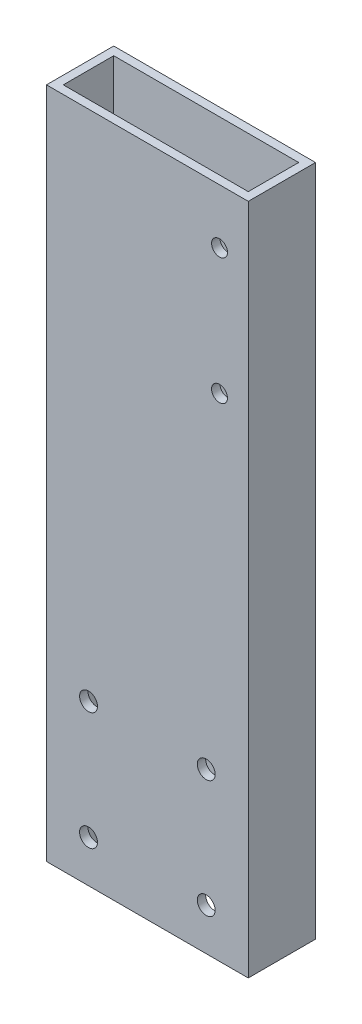
ISO-10303-21;
HEADER;
FILE_DESCRIPTION(('STEP AP214'),'2;1');
FILE_NAME('part.step','',(''),(''),'','','');
FILE_SCHEMA(('AUTOMOTIVE_DESIGN { 1 0 10303 214 1 1 1 1 }'));
ENDSEC;
DATA;
#1=APPLICATION_CONTEXT('core data for automotive mechanical design processes');
#2=APPLICATION_PROTOCOL_DEFINITION('international standard','automotive_design',2000,#1);
#3=PRODUCT_CONTEXT('',#1,'mechanical');
#4=PRODUCT('Part','Part','',(#3));
#5=PRODUCT_RELATED_PRODUCT_CATEGORY('part','',(#4));
#6=PRODUCT_DEFINITION_FORMATION('','',#4);
#7=PRODUCT_DEFINITION_CONTEXT('part definition',#1,'design');
#8=PRODUCT_DEFINITION('design','',#6,#7);
#9=PRODUCT_DEFINITION_SHAPE('','',#8);
#10=(LENGTH_UNIT() NAMED_UNIT(*) SI_UNIT(.MILLI.,.METRE.));
#11=(NAMED_UNIT(*) PLANE_ANGLE_UNIT() SI_UNIT($,.RADIAN.));
#12=(NAMED_UNIT(*) SI_UNIT($,.STERADIAN.) SOLID_ANGLE_UNIT());
#13=UNCERTAINTY_MEASURE_WITH_UNIT(LENGTH_MEASURE(1.E-05),#10,'distance_accuracy_value','');
#14=(GEOMETRIC_REPRESENTATION_CONTEXT(3) GLOBAL_UNCERTAINTY_ASSIGNED_CONTEXT((#13)) GLOBAL_UNIT_ASSIGNED_CONTEXT((#10,
#11,#12)) REPRESENTATION_CONTEXT('',''));
#15=CARTESIAN_POINT('',(0.,0.,0.));
#16=DIRECTION('',(0.,0.,1.));
#17=DIRECTION('',(1.,0.,0.));
#18=AXIS2_PLACEMENT_3D('',#15,#16,#17);
#19=CARTESIAN_POINT('',(0.,254.,0.));
#20=DIRECTION('',(0.,-1.,0.));
#21=DIRECTION('',(0.,0.,-1.));
#22=AXIS2_PLACEMENT_3D('',#19,#20,#21);
#23=PLANE('',#22);
#24=DIRECTION('',(0.,0.,1.));
#25=VECTOR('',#24,1.);
#26=CARTESIAN_POINT('',(0.,254.,0.));
#27=LINE('',#26,#25);
#28=CARTESIAN_POINT('',(0.,254.,-25.4));
#29=VERTEX_POINT('',#28);
#30=CARTESIAN_POINT('',(0.,254.,0.));
#31=VERTEX_POINT('',#30);
#32=EDGE_CURVE('E137',#29,#31,#27,.T.);
#33=ORIENTED_EDGE('',*,*,#32,.T.);
#34=DIRECTION('',(1.,0.,0.));
#35=VECTOR('',#34,1.);
#36=CARTESIAN_POINT('',(0.,254.,0.));
#37=LINE('',#36,#35);
#38=CARTESIAN_POINT('',(76.2,254.,0.));
#39=VERTEX_POINT('',#38);
#40=EDGE_CURVE('E140',#31,#39,#37,.T.);
#41=ORIENTED_EDGE('',*,*,#40,.T.);
#42=DIRECTION('',(0.,0.,-1.));
#43=VECTOR('',#42,1.);
#44=CARTESIAN_POINT('',(76.2,254.,0.));
#45=LINE('',#44,#43);
#46=CARTESIAN_POINT('',(76.2,254.,-25.4));
#47=VERTEX_POINT('',#46);
#48=EDGE_CURVE('E143',#39,#47,#45,.T.);
#49=ORIENTED_EDGE('',*,*,#48,.T.);
#50=DIRECTION('',(-1.,0.,0.));
#51=VECTOR('',#50,1.);
#52=CARTESIAN_POINT('',(0.,254.,-25.4));
#53=LINE('',#52,#51);
#54=EDGE_CURVE('E145',#47,#29,#53,.T.);
#55=ORIENTED_EDGE('',*,*,#54,.T.);
#56=EDGE_LOOP('',(#33,#41,#49,#55));
#57=FACE_BOUND('',#56,.T.);
#58=DIRECTION('',(0.,0.,1.));
#59=VECTOR('',#58,1.);
#60=CARTESIAN_POINT('',(3.175,254.,-3.175));
#61=LINE('',#60,#59);
#62=CARTESIAN_POINT('',(3.175,254.,-22.225));
#63=VERTEX_POINT('',#62);
#64=CARTESIAN_POINT('',(3.175,254.,-3.175));
#65=VERTEX_POINT('',#64);
#66=EDGE_CURVE('E99',#63,#65,#61,.T.);
#67=ORIENTED_EDGE('',*,*,#66,.F.);
#68=DIRECTION('',(-1.,0.,0.));
#69=VECTOR('',#68,1.);
#70=CARTESIAN_POINT('',(3.175,254.,-22.225));
#71=LINE('',#70,#69);
#72=CARTESIAN_POINT('',(73.025,254.,-22.225));
#73=VERTEX_POINT('',#72);
#74=EDGE_CURVE('E121',#73,#63,#71,.T.);
#75=ORIENTED_EDGE('',*,*,#74,.F.);
#76=DIRECTION('',(0.,0.,-1.));
#77=VECTOR('',#76,1.);
#78=CARTESIAN_POINT('',(73.025,254.,-3.175));
#79=LINE('',#78,#77);
#80=CARTESIAN_POINT('',(73.025,254.,-3.175));
#81=VERTEX_POINT('',#80);
#82=EDGE_CURVE('E119',#81,#73,#79,.T.);
#83=ORIENTED_EDGE('',*,*,#82,.F.);
#84=DIRECTION('',(1.,0.,0.));
#85=VECTOR('',#84,1.);
#86=CARTESIAN_POINT('',(3.175,254.,-3.175));
#87=LINE('',#86,#85);
#88=EDGE_CURVE('E107',#65,#81,#87,.T.);
#89=ORIENTED_EDGE('',*,*,#88,.F.);
#90=EDGE_LOOP('',(#67,#75,#83,#89));
#91=FACE_BOUND('',#90,.T.);
#92=ADVANCED_FACE('F32',(#57,#91),#23,.F.);
#93=CARTESIAN_POINT('',(0.,0.,0.));
#94=DIRECTION('',(0.,-1.,0.));
#95=DIRECTION('',(0.,0.,-1.));
#96=AXIS2_PLACEMENT_3D('',#93,#94,#95);
#97=PLANE('',#96);
#98=DIRECTION('',(0.,0.,1.));
#99=VECTOR('',#98,1.);
#100=CARTESIAN_POINT('',(0.,0.,0.));
#101=LINE('',#100,#99);
#102=CARTESIAN_POINT('',(0.,0.,-25.4));
#103=VERTEX_POINT('',#102);
#104=CARTESIAN_POINT('',(0.,0.,0.));
#105=VERTEX_POINT('',#104);
#106=EDGE_CURVE('E115',#103,#105,#101,.T.);
#107=ORIENTED_EDGE('',*,*,#106,.F.);
#108=DIRECTION('',(-1.,0.,0.));
#109=VECTOR('',#108,1.);
#110=CARTESIAN_POINT('',(0.,0.,-25.4));
#111=LINE('',#110,#109);
#112=CARTESIAN_POINT('',(76.2,0.,-25.4));
#113=VERTEX_POINT('',#112);
#114=EDGE_CURVE('E141',#113,#103,#111,.T.);
#115=ORIENTED_EDGE('',*,*,#114,.F.);
#116=DIRECTION('',(0.,0.,-1.));
#117=VECTOR('',#116,1.);
#118=CARTESIAN_POINT('',(76.2,0.,0.));
#119=LINE('',#118,#117);
#120=CARTESIAN_POINT('',(76.2,0.,0.));
#121=VERTEX_POINT('',#120);
#122=EDGE_CURVE('E152',#121,#113,#119,.T.);
#123=ORIENTED_EDGE('',*,*,#122,.F.);
#124=DIRECTION('',(1.,0.,0.));
#125=VECTOR('',#124,1.);
#126=CARTESIAN_POINT('',(0.,0.,0.));
#127=LINE('',#126,#125);
#128=EDGE_CURVE('E150',#105,#121,#127,.T.);
#129=ORIENTED_EDGE('',*,*,#128,.F.);
#130=EDGE_LOOP('',(#107,#115,#123,#129));
#131=FACE_BOUND('',#130,.T.);
#132=DIRECTION('',(-1.,0.,0.));
#133=VECTOR('',#132,1.);
#134=CARTESIAN_POINT('',(3.175,0.,-22.225));
#135=LINE('',#134,#133);
#136=CARTESIAN_POINT('',(73.025,0.,-22.225));
#137=VERTEX_POINT('',#136);
#138=CARTESIAN_POINT('',(3.175,0.,-22.225));
#139=VERTEX_POINT('',#138);
#140=EDGE_CURVE('E108',#137,#139,#135,.T.);
#141=ORIENTED_EDGE('',*,*,#140,.T.);
#142=DIRECTION('',(0.,0.,1.));
#143=VECTOR('',#142,1.);
#144=CARTESIAN_POINT('',(3.175,0.,-3.175));
#145=LINE('',#144,#143);
#146=CARTESIAN_POINT('',(3.175,0.,-3.175));
#147=VERTEX_POINT('',#146);
#148=EDGE_CURVE('E57',#139,#147,#145,.T.);
#149=ORIENTED_EDGE('',*,*,#148,.T.);
#150=DIRECTION('',(1.,0.,0.));
#151=VECTOR('',#150,1.);
#152=CARTESIAN_POINT('',(3.175,0.,-3.175));
#153=LINE('',#152,#151);
#154=CARTESIAN_POINT('',(73.025,0.,-3.175));
#155=VERTEX_POINT('',#154);
#156=EDGE_CURVE('E114',#147,#155,#153,.T.);
#157=ORIENTED_EDGE('',*,*,#156,.T.);
#158=DIRECTION('',(0.,0.,-1.));
#159=VECTOR('',#158,1.);
#160=CARTESIAN_POINT('',(73.025,0.,-3.175));
#161=LINE('',#160,#159);
#162=EDGE_CURVE('E129',#155,#137,#161,.T.);
#163=ORIENTED_EDGE('',*,*,#162,.T.);
#164=EDGE_LOOP('',(#141,#149,#157,#163));
#165=FACE_BOUND('',#164,.T.);
#166=ADVANCED_FACE('F246',(#131,#165),#97,.T.);
#167=CARTESIAN_POINT('',(0.,254.,0.));
#168=DIRECTION('',(1.,0.,0.));
#169=DIRECTION('',(0.,0.,-1.));
#170=AXIS2_PLACEMENT_3D('',#167,#168,#169);
#171=PLANE('',#170);
#172=ORIENTED_EDGE('',*,*,#106,.T.);
#173=DIRECTION('',(0.,-1.,0.));
#174=VECTOR('',#173,1.);
#175=CARTESIAN_POINT('',(0.,254.,0.));
#176=LINE('',#175,#174);
#177=EDGE_CURVE('E11',#31,#105,#176,.T.);
#178=ORIENTED_EDGE('',*,*,#177,.F.);
#179=ORIENTED_EDGE('',*,*,#32,.F.);
#180=DIRECTION('',(0.,-1.,0.));
#181=VECTOR('',#180,1.);
#182=CARTESIAN_POINT('',(0.,254.,-25.4));
#183=LINE('',#182,#181);
#184=EDGE_CURVE('E147',#29,#103,#183,.T.);
#185=ORIENTED_EDGE('',*,*,#184,.T.);
#186=EDGE_LOOP('',(#172,#178,#179,#185));
#187=FACE_BOUND('',#186,.T.);
#188=ADVANCED_FACE('F34',(#187),#171,.F.);
#189=CARTESIAN_POINT('',(0.,254.,0.));
#190=DIRECTION('',(0.,0.,-1.));
#191=DIRECTION('',(-1.,0.,0.));
#192=AXIS2_PLACEMENT_3D('',#189,#190,#191);
#193=PLANE('',#192);
#194=CARTESIAN_POINT('',(65.3474321253445,233.362499999999,0.));
#195=DIRECTION('',(0.,0.,-1.));
#196=DIRECTION('',(-1.,0.,0.));
#197=AXIS2_PLACEMENT_3D('',#194,#195,#196);
#198=CIRCLE('',#197,3.);
#199=CARTESIAN_POINT('',(62.3474321253445,233.362499999999,0.));
#200=VERTEX_POINT('',#199);
#201=EDGE_CURVE('E270',#200,#200,#198,.T.);
#202=ORIENTED_EDGE('',*,*,#201,.T.);
#203=EDGE_LOOP('',(#202));
#204=FACE_BOUND('',#203,.T.);
#205=CARTESIAN_POINT('',(65.3474321253444,185.737499999999,0.));
#206=DIRECTION('',(0.,0.,-1.));
#207=DIRECTION('',(-1.,0.,0.));
#208=AXIS2_PLACEMENT_3D('',#205,#206,#207);
#209=CIRCLE('',#208,2.99999999999999);
#210=CARTESIAN_POINT('',(62.3474321253444,185.737499999999,0.));
#211=VERTEX_POINT('',#210);
#212=EDGE_CURVE('E181',#211,#211,#209,.T.);
#213=ORIENTED_EDGE('',*,*,#212,.T.);
#214=EDGE_LOOP('',(#213));
#215=FACE_BOUND('',#214,.T.);
#216=CARTESIAN_POINT('',(15.875,15.875,0.));
#217=DIRECTION('',(0.,0.,-1.));
#218=DIRECTION('',(-1.,0.,0.));
#219=AXIS2_PLACEMENT_3D('',#216,#217,#218);
#220=CIRCLE('',#219,3.3782);
#221=CARTESIAN_POINT('',(12.4968,15.875,0.));
#222=VERTEX_POINT('',#221);
#223=EDGE_CURVE('E170',#222,#222,#220,.T.);
#224=ORIENTED_EDGE('',*,*,#223,.T.);
#225=EDGE_LOOP('',(#224));
#226=FACE_BOUND('',#225,.T.);
#227=CARTESIAN_POINT('',(15.875,60.325,0.));
#228=DIRECTION('',(0.,0.,-1.));
#229=DIRECTION('',(-1.,0.,0.));
#230=AXIS2_PLACEMENT_3D('',#227,#228,#229);
#231=CIRCLE('',#230,3.37820000000001);
#232=CARTESIAN_POINT('',(12.4968,60.325,0.));
#233=VERTEX_POINT('',#232);
#234=EDGE_CURVE('E203',#233,#233,#231,.T.);
#235=ORIENTED_EDGE('',*,*,#234,.T.);
#236=EDGE_LOOP('',(#235));
#237=FACE_BOUND('',#236,.T.);
#238=CARTESIAN_POINT('',(60.325,60.325,0.));
#239=DIRECTION('',(0.,0.,-1.));
#240=DIRECTION('',(-1.,0.,0.));
#241=AXIS2_PLACEMENT_3D('',#238,#239,#240);
#242=CIRCLE('',#241,3.3782);
#243=CARTESIAN_POINT('',(56.9468,60.325,0.));
#244=VERTEX_POINT('',#243);
#245=EDGE_CURVE('E209',#244,#244,#242,.T.);
#246=ORIENTED_EDGE('',*,*,#245,.T.);
#247=EDGE_LOOP('',(#246));
#248=FACE_BOUND('',#247,.T.);
#249=CARTESIAN_POINT('',(60.325,15.875,0.));
#250=DIRECTION('',(0.,0.,-1.));
#251=DIRECTION('',(-1.,0.,0.));
#252=AXIS2_PLACEMENT_3D('',#249,#250,#251);
#253=CIRCLE('',#252,3.37819999999999);
#254=CARTESIAN_POINT('',(56.9468,15.875,0.));
#255=VERTEX_POINT('',#254);
#256=EDGE_CURVE('E165',#255,#255,#253,.T.);
#257=ORIENTED_EDGE('',*,*,#256,.T.);
#258=EDGE_LOOP('',(#257));
#259=FACE_BOUND('',#258,.T.);
#260=ORIENTED_EDGE('',*,*,#128,.T.);
#261=DIRECTION('',(0.,-1.,0.));
#262=VECTOR('',#261,1.);
#263=CARTESIAN_POINT('',(76.2,254.,0.));
#264=LINE('',#263,#262);
#265=EDGE_CURVE('E41',#39,#121,#264,.T.);
#266=ORIENTED_EDGE('',*,*,#265,.F.);
#267=ORIENTED_EDGE('',*,*,#40,.F.);
#268=ORIENTED_EDGE('',*,*,#177,.T.);
#269=EDGE_LOOP('',(#260,#266,#267,#268));
#270=FACE_BOUND('',#269,.T.);
#271=ADVANCED_FACE('F260',(#204,#215,#226,#237,#248,#259,#270),#193,.F.);
#272=CARTESIAN_POINT('',(76.2,254.,0.));
#273=DIRECTION('',(-1.,0.,0.));
#274=DIRECTION('',(0.,0.,1.));
#275=AXIS2_PLACEMENT_3D('',#272,#273,#274);
#276=PLANE('',#275);
#277=ORIENTED_EDGE('',*,*,#122,.T.);
#278=DIRECTION('',(0.,-1.,0.));
#279=VECTOR('',#278,1.);
#280=CARTESIAN_POINT('',(76.2,254.,-25.4));
#281=LINE('',#280,#279);
#282=EDGE_CURVE('E157',#47,#113,#281,.T.);
#283=ORIENTED_EDGE('',*,*,#282,.F.);
#284=ORIENTED_EDGE('',*,*,#48,.F.);
#285=ORIENTED_EDGE('',*,*,#265,.T.);
#286=EDGE_LOOP('',(#277,#283,#284,#285));
#287=FACE_BOUND('',#286,.T.);
#288=ADVANCED_FACE('F257',(#287),#276,.F.);
#289=CARTESIAN_POINT('',(0.,254.,-25.4));
#290=DIRECTION('',(0.,0.,1.));
#291=DIRECTION('',(1.,0.,0.));
#292=AXIS2_PLACEMENT_3D('',#289,#290,#291);
#293=PLANE('',#292);
#294=CARTESIAN_POINT('',(65.3474321253445,233.362499999999,-25.4));
#295=DIRECTION('',(0.,0.,-1.));
#296=DIRECTION('',(-1.,0.,0.));
#297=AXIS2_PLACEMENT_3D('',#294,#295,#296);
#298=CIRCLE('',#297,3.);
#299=CARTESIAN_POINT('',(62.3474321253445,233.362499999999,-25.4));
#300=VERTEX_POINT('',#299);
#301=EDGE_CURVE('E338',#300,#300,#298,.T.);
#302=ORIENTED_EDGE('',*,*,#301,.F.);
#303=EDGE_LOOP('',(#302));
#304=FACE_BOUND('',#303,.T.);
#305=CARTESIAN_POINT('',(65.3474321253444,185.737499999999,-25.4));
#306=DIRECTION('',(0.,0.,-1.));
#307=DIRECTION('',(-1.,0.,0.));
#308=AXIS2_PLACEMENT_3D('',#305,#306,#307);
#309=CIRCLE('',#308,2.99999999999999);
#310=CARTESIAN_POINT('',(62.3474321253444,185.737499999999,-25.4));
#311=VERTEX_POINT('',#310);
#312=EDGE_CURVE('E188',#311,#311,#309,.T.);
#313=ORIENTED_EDGE('',*,*,#312,.F.);
#314=EDGE_LOOP('',(#313));
#315=FACE_BOUND('',#314,.T.);
#316=CARTESIAN_POINT('',(15.875,15.875,-25.4));
#317=DIRECTION('',(0.,0.,-1.));
#318=DIRECTION('',(-1.,0.,0.));
#319=AXIS2_PLACEMENT_3D('',#316,#317,#318);
#320=CIRCLE('',#319,3.3782);
#321=CARTESIAN_POINT('',(12.4968,15.875,-25.4));
#322=VERTEX_POINT('',#321);
#323=EDGE_CURVE('E200',#322,#322,#320,.T.);
#324=ORIENTED_EDGE('',*,*,#323,.F.);
#325=EDGE_LOOP('',(#324));
#326=FACE_BOUND('',#325,.T.);
#327=CARTESIAN_POINT('',(15.875,60.325,-25.4));
#328=DIRECTION('',(0.,0.,-1.));
#329=DIRECTION('',(-1.,0.,0.));
#330=AXIS2_PLACEMENT_3D('',#327,#328,#329);
#331=CIRCLE('',#330,3.37820000000001);
#332=CARTESIAN_POINT('',(12.4968,60.325,-25.4));
#333=VERTEX_POINT('',#332);
#334=EDGE_CURVE('E206',#333,#333,#331,.T.);
#335=ORIENTED_EDGE('',*,*,#334,.F.);
#336=EDGE_LOOP('',(#335));
#337=FACE_BOUND('',#336,.T.);
#338=CARTESIAN_POINT('',(60.325,60.325,-25.4));
#339=DIRECTION('',(0.,0.,-1.));
#340=DIRECTION('',(-1.,0.,0.));
#341=AXIS2_PLACEMENT_3D('',#338,#339,#340);
#342=CIRCLE('',#341,3.3782);
#343=CARTESIAN_POINT('',(56.9468,60.325,-25.4));
#344=VERTEX_POINT('',#343);
#345=EDGE_CURVE('E185',#344,#344,#342,.T.);
#346=ORIENTED_EDGE('',*,*,#345,.F.);
#347=EDGE_LOOP('',(#346));
#348=FACE_BOUND('',#347,.T.);
#349=CARTESIAN_POINT('',(60.325,15.875,-25.4));
#350=DIRECTION('',(0.,0.,-1.));
#351=DIRECTION('',(-1.,0.,0.));
#352=AXIS2_PLACEMENT_3D('',#349,#350,#351);
#353=CIRCLE('',#352,3.37819999999999);
#354=CARTESIAN_POINT('',(56.9468,15.875,-25.4));
#355=VERTEX_POINT('',#354);
#356=EDGE_CURVE('E220',#355,#355,#353,.T.);
#357=ORIENTED_EDGE('',*,*,#356,.F.);
#358=EDGE_LOOP('',(#357));
#359=FACE_BOUND('',#358,.T.);
#360=ORIENTED_EDGE('',*,*,#114,.T.);
#361=ORIENTED_EDGE('',*,*,#184,.F.);
#362=ORIENTED_EDGE('',*,*,#54,.F.);
#363=ORIENTED_EDGE('',*,*,#282,.T.);
#364=EDGE_LOOP('',(#360,#361,#362,#363));
#365=FACE_BOUND('',#364,.T.);
#366=ADVANCED_FACE('F241',(#304,#315,#326,#337,#348,#359,#365),#293,.F.);
#367=CARTESIAN_POINT('',(3.175,254.,-3.175));
#368=DIRECTION('',(1.,0.,0.));
#369=DIRECTION('',(0.,0.,-1.));
#370=AXIS2_PLACEMENT_3D('',#367,#368,#369);
#371=PLANE('',#370);
#372=ORIENTED_EDGE('',*,*,#148,.F.);
#373=DIRECTION('',(0.,-1.,0.));
#374=VECTOR('',#373,1.);
#375=CARTESIAN_POINT('',(3.175,254.,-22.225));
#376=LINE('',#375,#374);
#377=EDGE_CURVE('E103',#63,#139,#376,.T.);
#378=ORIENTED_EDGE('',*,*,#377,.F.);
#379=ORIENTED_EDGE('',*,*,#66,.T.);
#380=DIRECTION('',(0.,-1.,0.));
#381=VECTOR('',#380,1.);
#382=CARTESIAN_POINT('',(3.175,254.,-3.175));
#383=LINE('',#382,#381);
#384=EDGE_CURVE('E102',#65,#147,#383,.T.);
#385=ORIENTED_EDGE('',*,*,#384,.T.);
#386=EDGE_LOOP('',(#372,#378,#379,#385));
#387=FACE_BOUND('',#386,.T.);
#388=ADVANCED_FACE('F101',(#387),#371,.T.);
#389=CARTESIAN_POINT('',(3.175,254.,-3.175));
#390=DIRECTION('',(0.,0.,-1.));
#391=DIRECTION('',(-1.,0.,0.));
#392=AXIS2_PLACEMENT_3D('',#389,#390,#391);
#393=PLANE('',#392);
#394=CARTESIAN_POINT('',(65.3474321253445,233.362499999999,-3.175));
#395=DIRECTION('',(0.,0.,-1.));
#396=DIRECTION('',(-1.,0.,0.));
#397=AXIS2_PLACEMENT_3D('',#394,#395,#396);
#398=CIRCLE('',#397,3.);
#399=CARTESIAN_POINT('',(62.3474321253445,233.362499999999,-3.175));
#400=VERTEX_POINT('',#399);
#401=EDGE_CURVE('E193',#400,#400,#398,.T.);
#402=ORIENTED_EDGE('',*,*,#401,.F.);
#403=EDGE_LOOP('',(#402));
#404=FACE_BOUND('',#403,.T.);
#405=CARTESIAN_POINT('',(65.3474321253444,185.737499999999,-3.175));
#406=DIRECTION('',(0.,0.,-1.));
#407=DIRECTION('',(-1.,0.,0.));
#408=AXIS2_PLACEMENT_3D('',#405,#406,#407);
#409=CIRCLE('',#408,2.99999999999999);
#410=CARTESIAN_POINT('',(62.3474321253444,185.737499999999,-3.175));
#411=VERTEX_POINT('',#410);
#412=EDGE_CURVE('E180',#411,#411,#409,.T.);
#413=ORIENTED_EDGE('',*,*,#412,.F.);
#414=EDGE_LOOP('',(#413));
#415=FACE_BOUND('',#414,.T.);
#416=CARTESIAN_POINT('',(15.875,15.875,-3.175));
#417=DIRECTION('',(0.,0.,-1.));
#418=DIRECTION('',(-1.,0.,0.));
#419=AXIS2_PLACEMENT_3D('',#416,#417,#418);
#420=CIRCLE('',#419,3.3782);
#421=CARTESIAN_POINT('',(12.4968,15.875,-3.175));
#422=VERTEX_POINT('',#421);
#423=EDGE_CURVE('E177',#422,#422,#420,.T.);
#424=ORIENTED_EDGE('',*,*,#423,.F.);
#425=EDGE_LOOP('',(#424));
#426=FACE_BOUND('',#425,.T.);
#427=CARTESIAN_POINT('',(15.875,60.325,-3.175));
#428=DIRECTION('',(0.,0.,-1.));
#429=DIRECTION('',(-1.,0.,0.));
#430=AXIS2_PLACEMENT_3D('',#427,#428,#429);
#431=CIRCLE('',#430,3.37820000000001);
#432=CARTESIAN_POINT('',(12.4968,60.325,-3.175));
#433=VERTEX_POINT('',#432);
#434=EDGE_CURVE('E174',#433,#433,#431,.T.);
#435=ORIENTED_EDGE('',*,*,#434,.F.);
#436=EDGE_LOOP('',(#435));
#437=FACE_BOUND('',#436,.T.);
#438=CARTESIAN_POINT('',(60.325,60.325,-3.175));
#439=DIRECTION('',(0.,0.,-1.));
#440=DIRECTION('',(-1.,0.,0.));
#441=AXIS2_PLACEMENT_3D('',#438,#439,#440);
#442=CIRCLE('',#441,3.3782);
#443=CARTESIAN_POINT('',(56.9468,60.325,-3.175));
#444=VERTEX_POINT('',#443);
#445=EDGE_CURVE('E169',#444,#444,#442,.T.);
#446=ORIENTED_EDGE('',*,*,#445,.F.);
#447=EDGE_LOOP('',(#446));
#448=FACE_BOUND('',#447,.T.);
#449=CARTESIAN_POINT('',(60.325,15.875,-3.175));
#450=DIRECTION('',(0.,0.,-1.));
#451=DIRECTION('',(-1.,0.,0.));
#452=AXIS2_PLACEMENT_3D('',#449,#450,#451);
#453=CIRCLE('',#452,3.37819999999999);
#454=CARTESIAN_POINT('',(56.9468,15.875,-3.175));
#455=VERTEX_POINT('',#454);
#456=EDGE_CURVE('E127',#455,#455,#453,.T.);
#457=ORIENTED_EDGE('',*,*,#456,.F.);
#458=EDGE_LOOP('',(#457));
#459=FACE_BOUND('',#458,.T.);
#460=ORIENTED_EDGE('',*,*,#156,.F.);
#461=ORIENTED_EDGE('',*,*,#384,.F.);
#462=ORIENTED_EDGE('',*,*,#88,.T.);
#463=DIRECTION('',(0.,-1.,0.));
#464=VECTOR('',#463,1.);
#465=CARTESIAN_POINT('',(73.025,254.,-3.175));
#466=LINE('',#465,#464);
#467=EDGE_CURVE('E116',#81,#155,#466,.T.);
#468=ORIENTED_EDGE('',*,*,#467,.T.);
#469=EDGE_LOOP('',(#460,#461,#462,#468));
#470=FACE_BOUND('',#469,.T.);
#471=ADVANCED_FACE('F111',(#404,#415,#426,#437,#448,#459,#470),#393,.T.);
#472=CARTESIAN_POINT('',(73.025,254.,-3.175));
#473=DIRECTION('',(-1.,0.,0.));
#474=DIRECTION('',(0.,0.,1.));
#475=AXIS2_PLACEMENT_3D('',#472,#473,#474);
#476=PLANE('',#475);
#477=ORIENTED_EDGE('',*,*,#162,.F.);
#478=ORIENTED_EDGE('',*,*,#467,.F.);
#479=ORIENTED_EDGE('',*,*,#82,.T.);
#480=DIRECTION('',(0.,-1.,0.));
#481=VECTOR('',#480,1.);
#482=CARTESIAN_POINT('',(73.025,254.,-22.225));
#483=LINE('',#482,#481);
#484=EDGE_CURVE('E49',#73,#137,#483,.T.);
#485=ORIENTED_EDGE('',*,*,#484,.T.);
#486=EDGE_LOOP('',(#477,#478,#479,#485));
#487=FACE_BOUND('',#486,.T.);
#488=ADVANCED_FACE('F231',(#487),#476,.T.);
#489=CARTESIAN_POINT('',(3.175,254.,-22.225));
#490=DIRECTION('',(0.,0.,1.));
#491=DIRECTION('',(1.,0.,0.));
#492=AXIS2_PLACEMENT_3D('',#489,#490,#491);
#493=PLANE('',#492);
#494=CARTESIAN_POINT('',(65.3474321253445,233.362499999999,-22.225));
#495=DIRECTION('',(0.,0.,1.));
#496=DIRECTION('',(1.,0.,0.));
#497=AXIS2_PLACEMENT_3D('',#494,#495,#496);
#498=CIRCLE('',#497,3.);
#499=CARTESIAN_POINT('',(68.3474321253445,233.362499999999,-22.225));
#500=VERTEX_POINT('',#499);
#501=EDGE_CURVE('E36',#500,#500,#498,.T.);
#502=ORIENTED_EDGE('',*,*,#501,.F.);
#503=EDGE_LOOP('',(#502));
#504=FACE_BOUND('',#503,.T.);
#505=CARTESIAN_POINT('',(65.3474321253444,185.737499999999,-22.225));
#506=DIRECTION('',(0.,0.,1.));
#507=DIRECTION('',(1.,0.,0.));
#508=AXIS2_PLACEMENT_3D('',#505,#506,#507);
#509=CIRCLE('',#508,2.99999999999999);
#510=CARTESIAN_POINT('',(68.3474321253444,185.737499999999,-22.225));
#511=VERTEX_POINT('',#510);
#512=EDGE_CURVE('E178',#511,#511,#509,.T.);
#513=ORIENTED_EDGE('',*,*,#512,.F.);
#514=EDGE_LOOP('',(#513));
#515=FACE_BOUND('',#514,.T.);
#516=CARTESIAN_POINT('',(15.875,15.875,-22.225));
#517=DIRECTION('',(0.,0.,1.));
#518=DIRECTION('',(1.,0.,0.));
#519=AXIS2_PLACEMENT_3D('',#516,#517,#518);
#520=CIRCLE('',#519,3.3782);
#521=CARTESIAN_POINT('',(19.2532,15.875,-22.225));
#522=VERTEX_POINT('',#521);
#523=EDGE_CURVE('E175',#522,#522,#520,.T.);
#524=ORIENTED_EDGE('',*,*,#523,.F.);
#525=EDGE_LOOP('',(#524));
#526=FACE_BOUND('',#525,.T.);
#527=CARTESIAN_POINT('',(15.875,60.325,-22.225));
#528=DIRECTION('',(0.,0.,1.));
#529=DIRECTION('',(1.,0.,0.));
#530=AXIS2_PLACEMENT_3D('',#527,#528,#529);
#531=CIRCLE('',#530,3.37820000000001);
#532=CARTESIAN_POINT('',(19.2532,60.325,-22.225));
#533=VERTEX_POINT('',#532);
#534=EDGE_CURVE('E171',#533,#533,#531,.T.);
#535=ORIENTED_EDGE('',*,*,#534,.F.);
#536=EDGE_LOOP('',(#535));
#537=FACE_BOUND('',#536,.T.);
#538=CARTESIAN_POINT('',(60.325,60.325,-22.225));
#539=DIRECTION('',(0.,0.,1.));
#540=DIRECTION('',(1.,0.,0.));
#541=AXIS2_PLACEMENT_3D('',#538,#539,#540);
#542=CIRCLE('',#541,3.3782);
#543=CARTESIAN_POINT('',(63.7032,60.325,-22.225));
#544=VERTEX_POINT('',#543);
#545=EDGE_CURVE('E166',#544,#544,#542,.T.);
#546=ORIENTED_EDGE('',*,*,#545,.F.);
#547=EDGE_LOOP('',(#546));
#548=FACE_BOUND('',#547,.T.);
#549=CARTESIAN_POINT('',(60.325,15.875,-22.225));
#550=DIRECTION('',(0.,0.,1.));
#551=DIRECTION('',(1.,0.,0.));
#552=AXIS2_PLACEMENT_3D('',#549,#550,#551);
#553=CIRCLE('',#552,3.37819999999999);
#554=CARTESIAN_POINT('',(63.7032,15.875,-22.225));
#555=VERTEX_POINT('',#554);
#556=EDGE_CURVE('E162',#555,#555,#553,.T.);
#557=ORIENTED_EDGE('',*,*,#556,.F.);
#558=EDGE_LOOP('',(#557));
#559=FACE_BOUND('',#558,.T.);
#560=ORIENTED_EDGE('',*,*,#140,.F.);
#561=ORIENTED_EDGE('',*,*,#484,.F.);
#562=ORIENTED_EDGE('',*,*,#74,.T.);
#563=ORIENTED_EDGE('',*,*,#377,.T.);
#564=EDGE_LOOP('',(#560,#561,#562,#563));
#565=FACE_BOUND('',#564,.T.);
#566=ADVANCED_FACE('F238',(#504,#515,#526,#537,#548,#559,#565),#493,.T.);
#567=CARTESIAN_POINT('',(60.325,15.875,0.));
#568=DIRECTION('',(0.,0.,-1.));
#569=DIRECTION('',(-1.,0.,0.));
#570=AXIS2_PLACEMENT_3D('',#567,#568,#569);
#571=CYLINDRICAL_SURFACE('',#570,3.37819999999999);
#572=ORIENTED_EDGE('',*,*,#556,.T.);
#573=EDGE_LOOP('',(#572));
#574=FACE_BOUND('',#573,.T.);
#575=ORIENTED_EDGE('',*,*,#356,.T.);
#576=EDGE_LOOP('',(#575));
#577=FACE_BOUND('',#576,.T.);
#578=ADVANCED_FACE('F294',(#574,#577),#571,.F.);
#579=ORIENTED_EDGE('',*,*,#456,.T.);
#580=EDGE_LOOP('',(#579));
#581=FACE_BOUND('',#580,.T.);
#582=ORIENTED_EDGE('',*,*,#256,.F.);
#583=EDGE_LOOP('',(#582));
#584=FACE_BOUND('',#583,.T.);
#585=ADVANCED_FACE('F227',(#581,#584),#571,.F.);
#586=CARTESIAN_POINT('',(60.325,60.325,0.));
#587=DIRECTION('',(0.,0.,-1.));
#588=DIRECTION('',(-1.,0.,0.));
#589=AXIS2_PLACEMENT_3D('',#586,#587,#588);
#590=CYLINDRICAL_SURFACE('',#589,3.3782);
#591=ORIENTED_EDGE('',*,*,#545,.T.);
#592=EDGE_LOOP('',(#591));
#593=FACE_BOUND('',#592,.T.);
#594=ORIENTED_EDGE('',*,*,#345,.T.);
#595=EDGE_LOOP('',(#594));
#596=FACE_BOUND('',#595,.T.);
#597=ADVANCED_FACE('F305',(#593,#596),#590,.F.);
#598=CARTESIAN_POINT('',(15.875,60.325,0.));
#599=DIRECTION('',(0.,0.,-1.));
#600=DIRECTION('',(-1.,0.,0.));
#601=AXIS2_PLACEMENT_3D('',#598,#599,#600);
#602=CYLINDRICAL_SURFACE('',#601,3.37820000000001);
#603=ORIENTED_EDGE('',*,*,#534,.T.);
#604=EDGE_LOOP('',(#603));
#605=FACE_BOUND('',#604,.T.);
#606=ORIENTED_EDGE('',*,*,#334,.T.);
#607=EDGE_LOOP('',(#606));
#608=FACE_BOUND('',#607,.T.);
#609=ADVANCED_FACE('F308',(#605,#608),#602,.F.);
#610=CARTESIAN_POINT('',(15.875,15.875,0.));
#611=DIRECTION('',(0.,0.,-1.));
#612=DIRECTION('',(-1.,0.,0.));
#613=AXIS2_PLACEMENT_3D('',#610,#611,#612);
#614=CYLINDRICAL_SURFACE('',#613,3.3782);
#615=ORIENTED_EDGE('',*,*,#523,.T.);
#616=EDGE_LOOP('',(#615));
#617=FACE_BOUND('',#616,.T.);
#618=ORIENTED_EDGE('',*,*,#323,.T.);
#619=EDGE_LOOP('',(#618));
#620=FACE_BOUND('',#619,.T.);
#621=ADVANCED_FACE('F313',(#617,#620),#614,.F.);
#622=ORIENTED_EDGE('',*,*,#445,.T.);
#623=EDGE_LOOP('',(#622));
#624=FACE_BOUND('',#623,.T.);
#625=ORIENTED_EDGE('',*,*,#245,.F.);
#626=EDGE_LOOP('',(#625));
#627=FACE_BOUND('',#626,.T.);
#628=ADVANCED_FACE('F310',(#624,#627),#590,.F.);
#629=ORIENTED_EDGE('',*,*,#434,.T.);
#630=EDGE_LOOP('',(#629));
#631=FACE_BOUND('',#630,.T.);
#632=ORIENTED_EDGE('',*,*,#234,.F.);
#633=EDGE_LOOP('',(#632));
#634=FACE_BOUND('',#633,.T.);
#635=ADVANCED_FACE('F315',(#631,#634),#602,.F.);
#636=ORIENTED_EDGE('',*,*,#423,.T.);
#637=EDGE_LOOP('',(#636));
#638=FACE_BOUND('',#637,.T.);
#639=ORIENTED_EDGE('',*,*,#223,.F.);
#640=EDGE_LOOP('',(#639));
#641=FACE_BOUND('',#640,.T.);
#642=ADVANCED_FACE('F319',(#638,#641),#614,.F.);
#643=CARTESIAN_POINT('',(65.3474321253444,185.737499999999,0.));
#644=DIRECTION('',(0.,0.,-1.));
#645=DIRECTION('',(-1.,0.,0.));
#646=AXIS2_PLACEMENT_3D('',#643,#644,#645);
#647=CYLINDRICAL_SURFACE('',#646,2.99999999999999);
#648=ORIENTED_EDGE('',*,*,#512,.T.);
#649=EDGE_LOOP('',(#648));
#650=FACE_BOUND('',#649,.T.);
#651=ORIENTED_EDGE('',*,*,#312,.T.);
#652=EDGE_LOOP('',(#651));
#653=FACE_BOUND('',#652,.T.);
#654=ADVANCED_FACE('F320',(#650,#653),#647,.F.);
#655=ORIENTED_EDGE('',*,*,#412,.T.);
#656=EDGE_LOOP('',(#655));
#657=FACE_BOUND('',#656,.T.);
#658=ORIENTED_EDGE('',*,*,#212,.F.);
#659=EDGE_LOOP('',(#658));
#660=FACE_BOUND('',#659,.T.);
#661=ADVANCED_FACE('F323',(#657,#660),#647,.F.);
#662=CARTESIAN_POINT('',(65.3474321253445,233.362499999999,0.));
#663=DIRECTION('',(0.,0.,-1.));
#664=DIRECTION('',(-1.,0.,0.));
#665=AXIS2_PLACEMENT_3D('',#662,#663,#664);
#666=CYLINDRICAL_SURFACE('',#665,3.);
#667=ORIENTED_EDGE('',*,*,#501,.T.);
#668=EDGE_LOOP('',(#667));
#669=FACE_BOUND('',#668,.T.);
#670=ORIENTED_EDGE('',*,*,#301,.T.);
#671=EDGE_LOOP('',(#670));
#672=FACE_BOUND('',#671,.T.);
#673=ADVANCED_FACE('F324',(#669,#672),#666,.F.);
#674=ORIENTED_EDGE('',*,*,#401,.T.);
#675=EDGE_LOOP('',(#674));
#676=FACE_BOUND('',#675,.T.);
#677=ORIENTED_EDGE('',*,*,#201,.F.);
#678=EDGE_LOOP('',(#677));
#679=FACE_BOUND('',#678,.T.);
#680=ADVANCED_FACE('F326',(#676,#679),#666,.F.);
#681=CLOSED_SHELL('',(#92,#166,#188,#271,#288,#366,#388,#471,#488,#566,#578,#585,#597,#609,#621,
#628,#635,#642,#654,#661,#673,#680));
#682=MANIFOLD_SOLID_BREP('B2',#681);
#683=ADVANCED_BREP_SHAPE_REPRESENTATION('',(#18,#682),#14);
#684=SHAPE_DEFINITION_REPRESENTATION(#9,#683);
ENDSEC;
END-ISO-10303-21;
